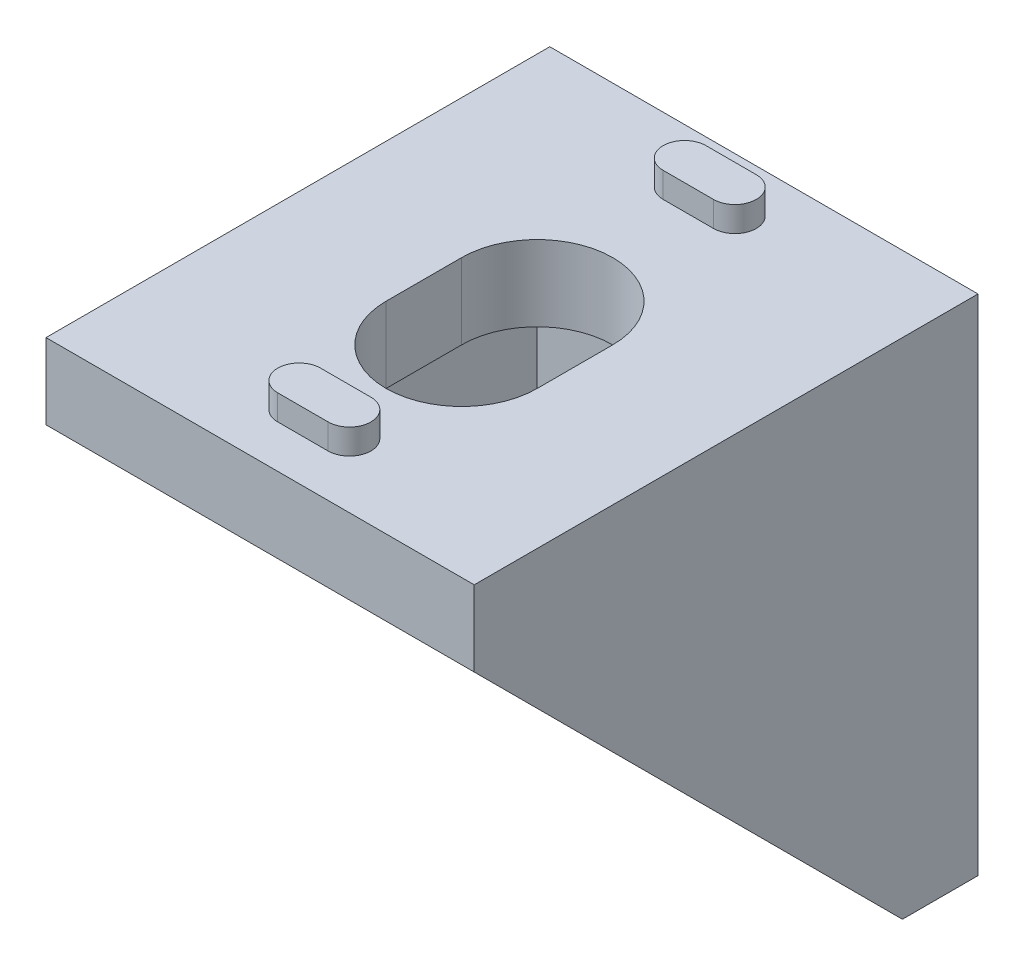
ISO-10303-21;
HEADER;
FILE_DESCRIPTION(('STEP AP214'),'2;1');
FILE_NAME('part.step','',(''),(''),'','','');
FILE_SCHEMA(('AUTOMOTIVE_DESIGN { 1 0 10303 214 1 1 1 1 }'));
ENDSEC;
DATA;
#1=APPLICATION_CONTEXT('core data for automotive mechanical design processes');
#2=APPLICATION_PROTOCOL_DEFINITION('international standard','automotive_design',2000,#1);
#3=PRODUCT_CONTEXT('',#1,'mechanical');
#4=PRODUCT('Part','Part','',(#3));
#5=PRODUCT_RELATED_PRODUCT_CATEGORY('part','',(#4));
#6=PRODUCT_DEFINITION_FORMATION('','',#4);
#7=PRODUCT_DEFINITION_CONTEXT('part definition',#1,'design');
#8=PRODUCT_DEFINITION('design','',#6,#7);
#9=PRODUCT_DEFINITION_SHAPE('','',#8);
#10=(LENGTH_UNIT() NAMED_UNIT(*) SI_UNIT(.MILLI.,.METRE.));
#11=(NAMED_UNIT(*) PLANE_ANGLE_UNIT() SI_UNIT($,.RADIAN.));
#12=(NAMED_UNIT(*) SI_UNIT($,.STERADIAN.) SOLID_ANGLE_UNIT());
#13=UNCERTAINTY_MEASURE_WITH_UNIT(LENGTH_MEASURE(1.E-05),#10,'distance_accuracy_value','');
#14=(GEOMETRIC_REPRESENTATION_CONTEXT(3) GLOBAL_UNCERTAINTY_ASSIGNED_CONTEXT((#13)) GLOBAL_UNIT_ASSIGNED_CONTEXT((#10,
#11,#12)) REPRESENTATION_CONTEXT('',''));
#15=CARTESIAN_POINT('',(0.,0.,0.));
#16=DIRECTION('',(0.,0.,1.));
#17=DIRECTION('',(1.,0.,0.));
#18=AXIS2_PLACEMENT_3D('',#15,#16,#17);
#19=CARTESIAN_POINT('',(8.5,0.,0.));
#20=DIRECTION('',(0.,-1.,0.));
#21=DIRECTION('',(0.,0.,-1.));
#22=AXIS2_PLACEMENT_3D('',#19,#20,#21);
#23=PLANE('',#22);
#24=DIRECTION('',(1.,0.,0.));
#25=VECTOR('',#24,1.);
#26=CARTESIAN_POINT('',(0.999999999999997,0.,16.6));
#27=LINE('',#26,#25);
#28=CARTESIAN_POINT('',(-1.,0.,16.6));
#29=VERTEX_POINT('',#28);
#30=CARTESIAN_POINT('',(0.999999999999997,0.,16.6));
#31=VERTEX_POINT('',#30);
#32=EDGE_CURVE('E274',#29,#31,#27,.T.);
#33=ORIENTED_EDGE('',*,*,#32,.T.);
#34=CARTESIAN_POINT('',(0.999999999999995,0.,17.45));
#35=DIRECTION('',(0.,-1.,0.));
#36=DIRECTION('',(0.,0.,-1.));
#37=AXIS2_PLACEMENT_3D('',#34,#35,#36);
#38=CIRCLE('',#37,0.85);
#39=CARTESIAN_POINT('',(0.999999999999997,0.,18.3));
#40=VERTEX_POINT('',#39);
#41=EDGE_CURVE('E248',#31,#40,#38,.T.);
#42=ORIENTED_EDGE('',*,*,#41,.T.);
#43=DIRECTION('',(-1.,0.,0.));
#44=VECTOR('',#43,1.);
#45=CARTESIAN_POINT('',(0.999999999999997,0.,18.3));
#46=LINE('',#45,#44);
#47=CARTESIAN_POINT('',(-0.999999999999999,0.,18.3));
#48=VERTEX_POINT('',#47);
#49=EDGE_CURVE('E264',#40,#48,#46,.T.);
#50=ORIENTED_EDGE('',*,*,#49,.T.);
#51=CARTESIAN_POINT('',(-1.,0.,17.45));
#52=DIRECTION('',(0.,-1.,0.));
#53=DIRECTION('',(0.,0.,1.));
#54=AXIS2_PLACEMENT_3D('',#51,#52,#53);
#55=CIRCLE('',#54,0.85);
#56=EDGE_CURVE('E48',#48,#29,#55,.T.);
#57=ORIENTED_EDGE('',*,*,#56,.T.);
#58=EDGE_LOOP('',(#33,#42,#50,#57));
#59=FACE_BOUND('',#58,.T.);
#60=DIRECTION('',(1.,0.,0.));
#61=VECTOR('',#60,1.);
#62=CARTESIAN_POINT('',(1.,0.,1.3));
#63=LINE('',#62,#61);
#64=CARTESIAN_POINT('',(-1.,0.,1.3));
#65=VERTEX_POINT('',#64);
#66=CARTESIAN_POINT('',(1.,0.,1.3));
#67=VERTEX_POINT('',#66);
#68=EDGE_CURVE('E299',#65,#67,#63,.T.);
#69=ORIENTED_EDGE('',*,*,#68,.T.);
#70=CARTESIAN_POINT('',(1.,0.,2.15));
#71=DIRECTION('',(0.,-1.,0.));
#72=DIRECTION('',(0.,0.,1.));
#73=AXIS2_PLACEMENT_3D('',#70,#71,#72);
#74=CIRCLE('',#73,0.85);
#75=CARTESIAN_POINT('',(1.,0.,3.));
#76=VERTEX_POINT('',#75);
#77=EDGE_CURVE('E253',#67,#76,#74,.T.);
#78=ORIENTED_EDGE('',*,*,#77,.T.);
#79=DIRECTION('',(-1.,0.,0.));
#80=VECTOR('',#79,1.);
#81=CARTESIAN_POINT('',(1.,0.,3.));
#82=LINE('',#81,#80);
#83=CARTESIAN_POINT('',(-0.999999999999999,0.,3.));
#84=VERTEX_POINT('',#83);
#85=EDGE_CURVE('E287',#76,#84,#82,.T.);
#86=ORIENTED_EDGE('',*,*,#85,.T.);
#87=CARTESIAN_POINT('',(-1.,0.,2.15));
#88=DIRECTION('',(0.,-1.,0.));
#89=DIRECTION('',(0.,0.,-1.));
#90=AXIS2_PLACEMENT_3D('',#87,#88,#89);
#91=CIRCLE('',#90,0.85);
#92=EDGE_CURVE('E56',#84,#65,#91,.T.);
#93=ORIENTED_EDGE('',*,*,#92,.T.);
#94=EDGE_LOOP('',(#69,#78,#86,#93));
#95=FACE_BOUND('',#94,.T.);
#96=DIRECTION('',(0.,0.,1.));
#97=VECTOR('',#96,1.);
#98=CARTESIAN_POINT('',(-8.5,0.,0.));
#99=LINE('',#98,#97);
#100=CARTESIAN_POINT('',(-8.5,0.,0.));
#101=VERTEX_POINT('',#100);
#102=CARTESIAN_POINT('',(-8.5,0.,20.));
#103=VERTEX_POINT('',#102);
#104=EDGE_CURVE('E477',#101,#103,#99,.T.);
#105=ORIENTED_EDGE('',*,*,#104,.T.);
#106=DIRECTION('',(-1.,0.,0.));
#107=VECTOR('',#106,1.);
#108=CARTESIAN_POINT('',(8.5,0.,20.));
#109=LINE('',#108,#107);
#110=CARTESIAN_POINT('',(8.5,0.,20.));
#111=VERTEX_POINT('',#110);
#112=EDGE_CURVE('E496',#111,#103,#109,.T.);
#113=ORIENTED_EDGE('',*,*,#112,.F.);
#114=DIRECTION('',(0.,0.,1.));
#115=VECTOR('',#114,1.);
#116=CARTESIAN_POINT('',(8.5,0.,0.));
#117=LINE('',#116,#115);
#118=CARTESIAN_POINT('',(8.5,0.,0.));
#119=VERTEX_POINT('',#118);
#120=EDGE_CURVE('E465',#119,#111,#117,.T.);
#121=ORIENTED_EDGE('',*,*,#120,.F.);
#122=DIRECTION('',(-1.,0.,0.));
#123=VECTOR('',#122,1.);
#124=CARTESIAN_POINT('',(8.5,0.,0.));
#125=LINE('',#124,#123);
#126=EDGE_CURVE('E499',#119,#101,#125,.T.);
#127=ORIENTED_EDGE('',*,*,#126,.T.);
#128=EDGE_LOOP('',(#105,#113,#121,#127));
#129=FACE_BOUND('',#128,.T.);
#130=CARTESIAN_POINT('',(0.,0.,9.00000000000001));
#131=DIRECTION('',(0.,-1.,0.));
#132=DIRECTION('',(0.,0.,-1.));
#133=AXIS2_PLACEMENT_3D('',#130,#131,#132);
#134=CIRCLE('',#133,3.);
#135=CARTESIAN_POINT('',(-3.,0.,9.));
#136=VERTEX_POINT('',#135);
#137=CARTESIAN_POINT('',(3.,0.,9.));
#138=VERTEX_POINT('',#137);
#139=EDGE_CURVE('E318',#136,#138,#134,.T.);
#140=ORIENTED_EDGE('',*,*,#139,.T.);
#141=DIRECTION('',(0.,0.,1.));
#142=VECTOR('',#141,1.);
#143=CARTESIAN_POINT('',(3.,0.,9.00000000000001));
#144=LINE('',#143,#142);
#145=CARTESIAN_POINT('',(3.,0.,12.));
#146=VERTEX_POINT('',#145);
#147=EDGE_CURVE('E336',#138,#146,#144,.T.);
#148=ORIENTED_EDGE('',*,*,#147,.T.);
#149=CARTESIAN_POINT('',(0.,0.,12.));
#150=DIRECTION('',(0.,-1.,0.));
#151=DIRECTION('',(0.,0.,-1.));
#152=AXIS2_PLACEMENT_3D('',#149,#150,#151);
#153=CIRCLE('',#152,3.);
#154=CARTESIAN_POINT('',(-3.,0.,12.));
#155=VERTEX_POINT('',#154);
#156=EDGE_CURVE('E312',#146,#155,#153,.T.);
#157=ORIENTED_EDGE('',*,*,#156,.T.);
#158=DIRECTION('',(0.,0.,-1.));
#159=VECTOR('',#158,1.);
#160=CARTESIAN_POINT('',(-3.,0.,9.00000000000001));
#161=LINE('',#160,#159);
#162=EDGE_CURVE('E315',#155,#136,#161,.T.);
#163=ORIENTED_EDGE('',*,*,#162,.T.);
#164=EDGE_LOOP('',(#140,#148,#157,#163));
#165=FACE_BOUND('',#164,.T.);
#166=ADVANCED_FACE('F33',(#59,#95,#129,#165),#23,.F.);
#167=CARTESIAN_POINT('',(-6.,-3.,2.99999999999999));
#168=DIRECTION('',(0.,1.,0.));
#169=DIRECTION('',(0.,0.,1.));
#170=AXIS2_PLACEMENT_3D('',#167,#168,#169);
#171=PLANE('',#170);
#172=DIRECTION('',(0.,0.,1.));
#173=VECTOR('',#172,1.);
#174=CARTESIAN_POINT('',(6.,-3.,2.99999999999999));
#175=LINE('',#174,#173);
#176=CARTESIAN_POINT('',(6.,-3.,2.99999999999999));
#177=VERTEX_POINT('',#176);
#178=CARTESIAN_POINT('',(6.,-3.,20.));
#179=VERTEX_POINT('',#178);
#180=EDGE_CURVE('E447',#177,#179,#175,.T.);
#181=ORIENTED_EDGE('',*,*,#180,.T.);
#182=DIRECTION('',(1.,0.,0.));
#183=VECTOR('',#182,1.);
#184=CARTESIAN_POINT('',(-6.,-3.,20.));
#185=LINE('',#184,#183);
#186=CARTESIAN_POINT('',(-6.,-3.,20.));
#187=VERTEX_POINT('',#186);
#188=EDGE_CURVE('E458',#187,#179,#185,.T.);
#189=ORIENTED_EDGE('',*,*,#188,.F.);
#190=DIRECTION('',(0.,0.,1.));
#191=VECTOR('',#190,1.);
#192=CARTESIAN_POINT('',(-6.,-3.,2.99999999999999));
#193=LINE('',#192,#191);
#194=CARTESIAN_POINT('',(-6.,-3.,2.99999999999999));
#195=VERTEX_POINT('',#194);
#196=EDGE_CURVE('E446',#195,#187,#193,.T.);
#197=ORIENTED_EDGE('',*,*,#196,.F.);
#198=DIRECTION('',(1.,0.,0.));
#199=VECTOR('',#198,1.);
#200=CARTESIAN_POINT('',(-6.,-3.,2.99999999999999));
#201=LINE('',#200,#199);
#202=EDGE_CURVE('E450',#195,#177,#201,.T.);
#203=ORIENTED_EDGE('',*,*,#202,.T.);
#204=EDGE_LOOP('',(#181,#189,#197,#203));
#205=FACE_BOUND('',#204,.T.);
#206=CARTESIAN_POINT('',(0.,-3.,9.));
#207=DIRECTION('',(0.,1.,0.));
#208=DIRECTION('',(-1.,0.,0.));
#209=AXIS2_PLACEMENT_3D('',#206,#207,#208);
#210=CIRCLE('',#209,3.);
#211=CARTESIAN_POINT('',(3.,-3.,9.));
#212=VERTEX_POINT('',#211);
#213=CARTESIAN_POINT('',(-3.,-3.,9.));
#214=VERTEX_POINT('',#213);
#215=EDGE_CURVE('E321',#212,#214,#210,.T.);
#216=ORIENTED_EDGE('',*,*,#215,.T.);
#217=DIRECTION('',(0.,0.,1.));
#218=VECTOR('',#217,1.);
#219=CARTESIAN_POINT('',(-3.,-3.,9.));
#220=LINE('',#219,#218);
#221=CARTESIAN_POINT('',(-3.,-3.,12.));
#222=VERTEX_POINT('',#221);
#223=EDGE_CURVE('E330',#214,#222,#220,.T.);
#224=ORIENTED_EDGE('',*,*,#223,.T.);
#225=CARTESIAN_POINT('',(0.,-3.,12.));
#226=DIRECTION('',(0.,1.,0.));
#227=DIRECTION('',(1.,0.,0.));
#228=AXIS2_PLACEMENT_3D('',#225,#226,#227);
#229=CIRCLE('',#228,3.);
#230=CARTESIAN_POINT('',(3.,-3.,12.));
#231=VERTEX_POINT('',#230);
#232=EDGE_CURVE('E327',#222,#231,#229,.T.);
#233=ORIENTED_EDGE('',*,*,#232,.T.);
#234=DIRECTION('',(0.,0.,-1.));
#235=VECTOR('',#234,1.);
#236=CARTESIAN_POINT('',(3.,-3.,9.));
#237=LINE('',#236,#235);
#238=EDGE_CURVE('E324',#231,#212,#237,.T.);
#239=ORIENTED_EDGE('',*,*,#238,.T.);
#240=EDGE_LOOP('',(#216,#224,#233,#239));
#241=FACE_BOUND('',#240,.T.);
#242=ADVANCED_FACE('F509',(#205,#241),#171,.F.);
#243=CARTESIAN_POINT('',(8.5,0.,0.));
#244=DIRECTION('',(0.,0.,1.));
#245=DIRECTION('',(0.,-1.,0.));
#246=AXIS2_PLACEMENT_3D('',#243,#244,#245);
#247=PLANE('',#246);
#248=CARTESIAN_POINT('',(1.,-2.15,0.));
#249=DIRECTION('',(0.,0.,-1.));
#250=DIRECTION('',(0.,-1.,0.));
#251=AXIS2_PLACEMENT_3D('',#248,#249,#250);
#252=CIRCLE('',#251,0.85);
#253=CARTESIAN_POINT('',(1.,-1.3,0.));
#254=VERTEX_POINT('',#253);
#255=CARTESIAN_POINT('',(1.,-3.,0.));
#256=VERTEX_POINT('',#255);
#257=EDGE_CURVE('E378',#254,#256,#252,.T.);
#258=ORIENTED_EDGE('',*,*,#257,.F.);
#259=DIRECTION('',(1.,0.,0.));
#260=VECTOR('',#259,1.);
#261=CARTESIAN_POINT('',(1.,-1.3,0.));
#262=LINE('',#261,#260);
#263=CARTESIAN_POINT('',(-0.999999999999999,-1.3,0.));
#264=VERTEX_POINT('',#263);
#265=EDGE_CURVE('E383',#264,#254,#262,.T.);
#266=ORIENTED_EDGE('',*,*,#265,.F.);
#267=CARTESIAN_POINT('',(-1.,-2.15,0.));
#268=DIRECTION('',(0.,0.,-1.));
#269=DIRECTION('',(0.,1.,0.));
#270=AXIS2_PLACEMENT_3D('',#267,#268,#269);
#271=CIRCLE('',#270,0.85);
#272=CARTESIAN_POINT('',(-1.,-3.,0.));
#273=VERTEX_POINT('',#272);
#274=EDGE_CURVE('E395',#273,#264,#271,.T.);
#275=ORIENTED_EDGE('',*,*,#274,.F.);
#276=DIRECTION('',(-1.,0.,0.));
#277=VECTOR('',#276,1.);
#278=CARTESIAN_POINT('',(1.,-3.,0.));
#279=LINE('',#278,#277);
#280=EDGE_CURVE('E392',#256,#273,#279,.T.);
#281=ORIENTED_EDGE('',*,*,#280,.F.);
#282=EDGE_LOOP('',(#258,#266,#275,#281));
#283=FACE_BOUND('',#282,.T.);
#284=DIRECTION('',(0.,-1.,0.));
#285=VECTOR('',#284,1.);
#286=CARTESIAN_POINT('',(3.,-9.00000000000001,0.));
#287=LINE('',#286,#285);
#288=CARTESIAN_POINT('',(3.,-9.00000000000001,0.));
#289=VERTEX_POINT('',#288);
#290=CARTESIAN_POINT('',(3.,-12.,0.));
#291=VERTEX_POINT('',#290);
#292=EDGE_CURVE('E413',#289,#291,#287,.T.);
#293=ORIENTED_EDGE('',*,*,#292,.F.);
#294=CARTESIAN_POINT('',(0.,-9.00000000000001,0.));
#295=DIRECTION('',(0.,0.,1.));
#296=DIRECTION('',(0.,-1.,0.));
#297=AXIS2_PLACEMENT_3D('',#294,#295,#296);
#298=CIRCLE('',#297,3.);
#299=CARTESIAN_POINT('',(-3.,-9.00000000000001,0.));
#300=VERTEX_POINT('',#299);
#301=EDGE_CURVE('E416',#300,#289,#298,.F.);
#302=ORIENTED_EDGE('',*,*,#301,.F.);
#303=DIRECTION('',(0.,1.,0.));
#304=VECTOR('',#303,1.);
#305=CARTESIAN_POINT('',(-3.,-9.00000000000001,0.));
#306=LINE('',#305,#304);
#307=CARTESIAN_POINT('',(-3.,-12.,0.));
#308=VERTEX_POINT('',#307);
#309=EDGE_CURVE('E433',#308,#300,#306,.T.);
#310=ORIENTED_EDGE('',*,*,#309,.F.);
#311=CARTESIAN_POINT('',(0.,-12.,0.));
#312=DIRECTION('',(0.,0.,1.));
#313=DIRECTION('',(0.,-1.,0.));
#314=AXIS2_PLACEMENT_3D('',#311,#312,#313);
#315=CIRCLE('',#314,3.);
#316=EDGE_CURVE('E411',#291,#308,#315,.F.);
#317=ORIENTED_EDGE('',*,*,#316,.F.);
#318=EDGE_LOOP('',(#293,#302,#310,#317));
#319=FACE_BOUND('',#318,.T.);
#320=DIRECTION('',(0.,1.,0.));
#321=VECTOR('',#320,1.);
#322=CARTESIAN_POINT('',(-8.5,0.,0.));
#323=LINE('',#322,#321);
#324=CARTESIAN_POINT('',(-8.5,-20.,0.));
#325=VERTEX_POINT('',#324);
#326=EDGE_CURVE('E457',#325,#101,#323,.T.);
#327=ORIENTED_EDGE('',*,*,#326,.T.);
#328=ORIENTED_EDGE('',*,*,#126,.F.);
#329=DIRECTION('',(0.,1.,0.));
#330=VECTOR('',#329,1.);
#331=CARTESIAN_POINT('',(8.5,0.,0.));
#332=LINE('',#331,#330);
#333=CARTESIAN_POINT('',(8.5,-20.,0.));
#334=VERTEX_POINT('',#333);
#335=EDGE_CURVE('E462',#334,#119,#332,.T.);
#336=ORIENTED_EDGE('',*,*,#335,.F.);
#337=DIRECTION('',(-1.,0.,0.));
#338=VECTOR('',#337,1.);
#339=CARTESIAN_POINT('',(8.5,-20.,0.));
#340=LINE('',#339,#338);
#341=EDGE_CURVE('E474',#334,#325,#340,.T.);
#342=ORIENTED_EDGE('',*,*,#341,.T.);
#343=EDGE_LOOP('',(#327,#328,#336,#342));
#344=FACE_BOUND('',#343,.T.);
#345=CARTESIAN_POINT('',(0.999999999999995,-17.45,0.));
#346=DIRECTION('',(0.,0.,-1.));
#347=DIRECTION('',(0.,1.,0.));
#348=AXIS2_PLACEMENT_3D('',#345,#346,#347);
#349=CIRCLE('',#348,0.85);
#350=CARTESIAN_POINT('',(0.999999999999997,-16.6,0.));
#351=VERTEX_POINT('',#350);
#352=CARTESIAN_POINT('',(0.999999999999997,-18.3,0.));
#353=VERTEX_POINT('',#352);
#354=EDGE_CURVE('E345',#351,#353,#349,.T.);
#355=ORIENTED_EDGE('',*,*,#354,.F.);
#356=DIRECTION('',(1.,0.,0.));
#357=VECTOR('',#356,1.);
#358=CARTESIAN_POINT('',(0.999999999999997,-16.6,0.));
#359=LINE('',#358,#357);
#360=CARTESIAN_POINT('',(-1.,-16.6,0.));
#361=VERTEX_POINT('',#360);
#362=EDGE_CURVE('E350',#361,#351,#359,.T.);
#363=ORIENTED_EDGE('',*,*,#362,.F.);
#364=CARTESIAN_POINT('',(-1.,-17.45,0.));
#365=DIRECTION('',(0.,0.,-1.));
#366=DIRECTION('',(0.,-1.,0.));
#367=AXIS2_PLACEMENT_3D('',#364,#365,#366);
#368=CIRCLE('',#367,0.85);
#369=CARTESIAN_POINT('',(-1.,-18.3,0.));
#370=VERTEX_POINT('',#369);
#371=EDGE_CURVE('E362',#370,#361,#368,.T.);
#372=ORIENTED_EDGE('',*,*,#371,.F.);
#373=DIRECTION('',(-1.,0.,0.));
#374=VECTOR('',#373,1.);
#375=CARTESIAN_POINT('',(0.999999999999997,-18.3,0.));
#376=LINE('',#375,#374);
#377=EDGE_CURVE('E359',#353,#370,#376,.T.);
#378=ORIENTED_EDGE('',*,*,#377,.F.);
#379=EDGE_LOOP('',(#355,#363,#372,#378));
#380=FACE_BOUND('',#379,.T.);
#381=ADVANCED_FACE('F35',(#283,#319,#344,#380),#247,.F.);
#382=CARTESIAN_POINT('',(8.5,-20.,2.99999999999999));
#383=DIRECTION('',(0.,0.707106781186548,-0.707106781186547));
#384=DIRECTION('',(0.,0.707106781186547,0.707106781186548));
#385=AXIS2_PLACEMENT_3D('',#382,#383,#384);
#386=PLANE('',#385);
#387=DIRECTION('',(0.,0.707106781186547,0.707106781186548));
#388=VECTOR('',#387,1.);
#389=CARTESIAN_POINT('',(6.,-20.,2.99999999999999));
#390=LINE('',#389,#388);
#391=CARTESIAN_POINT('',(6.,-20.,2.99999999999999));
#392=VERTEX_POINT('',#391);
#393=EDGE_CURVE('E41',#392,#179,#390,.T.);
#394=ORIENTED_EDGE('',*,*,#393,.F.);
#395=DIRECTION('',(-1.,0.,0.));
#396=VECTOR('',#395,1.);
#397=CARTESIAN_POINT('',(8.5,-20.,2.99999999999999));
#398=LINE('',#397,#396);
#399=CARTESIAN_POINT('',(8.5,-20.,2.99999999999999));
#400=VERTEX_POINT('',#399);
#401=EDGE_CURVE('E489',#400,#392,#398,.T.);
#402=ORIENTED_EDGE('',*,*,#401,.F.);
#403=DIRECTION('',(0.,-0.707106781186548,-0.707106781186548));
#404=VECTOR('',#403,1.);
#405=CARTESIAN_POINT('',(8.5,-3.,20.));
#406=LINE('',#405,#404);
#407=CARTESIAN_POINT('',(8.5,-3.,20.));
#408=VERTEX_POINT('',#407);
#409=EDGE_CURVE('E470',#408,#400,#406,.T.);
#410=ORIENTED_EDGE('',*,*,#409,.F.);
#411=DIRECTION('',(-1.,0.,0.));
#412=VECTOR('',#411,1.);
#413=CARTESIAN_POINT('',(8.5,-3.,20.));
#414=LINE('',#413,#412);
#415=EDGE_CURVE('E493',#408,#179,#414,.T.);
#416=ORIENTED_EDGE('',*,*,#415,.T.);
#417=EDGE_LOOP('',(#394,#402,#410,#416));
#418=FACE_BOUND('',#417,.T.);
#419=ADVANCED_FACE('F518',(#418),#386,.F.);
#420=CARTESIAN_POINT('',(8.5,0.,20.));
#421=DIRECTION('',(0.,0.,-1.));
#422=DIRECTION('',(-1.,0.,0.));
#423=AXIS2_PLACEMENT_3D('',#420,#421,#422);
#424=PLANE('',#423);
#425=DIRECTION('',(0.,-1.,0.));
#426=VECTOR('',#425,1.);
#427=CARTESIAN_POINT('',(-8.5,0.,20.));
#428=LINE('',#427,#426);
#429=CARTESIAN_POINT('',(-8.5,-3.,20.));
#430=VERTEX_POINT('',#429);
#431=EDGE_CURVE('E479',#103,#430,#428,.T.);
#432=ORIENTED_EDGE('',*,*,#431,.T.);
#433=EDGE_CURVE('E492',#187,#430,#414,.T.);
#434=ORIENTED_EDGE('',*,*,#433,.F.);
#435=ORIENTED_EDGE('',*,*,#188,.T.);
#436=ORIENTED_EDGE('',*,*,#415,.F.);
#437=DIRECTION('',(0.,-1.,0.));
#438=VECTOR('',#437,1.);
#439=CARTESIAN_POINT('',(8.5,0.,20.));
#440=LINE('',#439,#438);
#441=EDGE_CURVE('E468',#111,#408,#440,.T.);
#442=ORIENTED_EDGE('',*,*,#441,.F.);
#443=ORIENTED_EDGE('',*,*,#112,.T.);
#444=EDGE_LOOP('',(#432,#434,#435,#436,#442,#443));
#445=FACE_BOUND('',#444,.T.);
#446=ADVANCED_FACE('F515',(#445),#424,.F.);
#447=CARTESIAN_POINT('',(-6.,-20.,2.99999999999999));
#448=VERTEX_POINT('',#447);
#449=CARTESIAN_POINT('',(-8.5,-20.,2.99999999999999));
#450=VERTEX_POINT('',#449);
#451=EDGE_CURVE('E488',#448,#450,#398,.T.);
#452=ORIENTED_EDGE('',*,*,#451,.F.);
#453=DIRECTION('',(0.,0.707106781186547,0.707106781186548));
#454=VECTOR('',#453,1.);
#455=CARTESIAN_POINT('',(-6.,-20.,2.99999999999999));
#456=LINE('',#455,#454);
#457=EDGE_CURVE('E11',#448,#187,#456,.T.);
#458=ORIENTED_EDGE('',*,*,#457,.T.);
#459=ORIENTED_EDGE('',*,*,#433,.T.);
#460=DIRECTION('',(0.,-0.707106781186547,-0.707106781186548));
#461=VECTOR('',#460,1.);
#462=CARTESIAN_POINT('',(-8.5,-20.,2.99999999999999));
#463=LINE('',#462,#461);
#464=EDGE_CURVE('E482',#430,#450,#463,.T.);
#465=ORIENTED_EDGE('',*,*,#464,.T.);
#466=EDGE_LOOP('',(#452,#458,#459,#465));
#467=FACE_BOUND('',#466,.T.);
#468=ADVANCED_FACE('F533',(#467),#386,.F.);
#469=CARTESIAN_POINT('',(8.5,-20.,0.));
#470=DIRECTION('',(0.,1.,0.));
#471=DIRECTION('',(0.,0.,1.));
#472=AXIS2_PLACEMENT_3D('',#469,#470,#471);
#473=PLANE('',#472);
#474=DIRECTION('',(0.,0.,-1.));
#475=VECTOR('',#474,1.);
#476=CARTESIAN_POINT('',(-8.5,-20.,0.));
#477=LINE('',#476,#475);
#478=EDGE_CURVE('E466',#450,#325,#477,.T.);
#479=ORIENTED_EDGE('',*,*,#478,.T.);
#480=ORIENTED_EDGE('',*,*,#341,.F.);
#481=DIRECTION('',(0.,0.,-1.));
#482=VECTOR('',#481,1.);
#483=CARTESIAN_POINT('',(8.5,-20.,0.));
#484=LINE('',#483,#482);
#485=EDGE_CURVE('E472',#400,#334,#484,.T.);
#486=ORIENTED_EDGE('',*,*,#485,.F.);
#487=ORIENTED_EDGE('',*,*,#401,.T.);
#488=DIRECTION('',(1.,0.,0.));
#489=VECTOR('',#488,1.);
#490=CARTESIAN_POINT('',(-6.,-20.,2.99999999999999));
#491=LINE('',#490,#489);
#492=EDGE_CURVE('E455',#448,#392,#491,.T.);
#493=ORIENTED_EDGE('',*,*,#492,.F.);
#494=ORIENTED_EDGE('',*,*,#451,.T.);
#495=EDGE_LOOP('',(#479,#480,#486,#487,#493,#494));
#496=FACE_BOUND('',#495,.T.);
#497=ADVANCED_FACE('F541',(#496),#473,.F.);
#498=CARTESIAN_POINT('',(8.5,0.,0.));
#499=DIRECTION('',(-1.,0.,0.));
#500=DIRECTION('',(0.,0.,1.));
#501=AXIS2_PLACEMENT_3D('',#498,#499,#500);
#502=PLANE('',#501);
#503=ORIENTED_EDGE('',*,*,#335,.T.);
#504=ORIENTED_EDGE('',*,*,#120,.T.);
#505=ORIENTED_EDGE('',*,*,#441,.T.);
#506=ORIENTED_EDGE('',*,*,#409,.T.);
#507=ORIENTED_EDGE('',*,*,#485,.T.);
#508=EDGE_LOOP('',(#503,#504,#505,#506,#507));
#509=FACE_BOUND('',#508,.T.);
#510=ADVANCED_FACE('F521',(#509),#502,.F.);
#511=CARTESIAN_POINT('',(-8.5,0.,0.));
#512=DIRECTION('',(-1.,0.,0.));
#513=DIRECTION('',(0.,0.,1.));
#514=AXIS2_PLACEMENT_3D('',#511,#512,#513);
#515=PLANE('',#514);
#516=ORIENTED_EDGE('',*,*,#326,.F.);
#517=ORIENTED_EDGE('',*,*,#478,.F.);
#518=ORIENTED_EDGE('',*,*,#464,.F.);
#519=ORIENTED_EDGE('',*,*,#431,.F.);
#520=ORIENTED_EDGE('',*,*,#104,.F.);
#521=EDGE_LOOP('',(#516,#517,#518,#519,#520));
#522=FACE_BOUND('',#521,.T.);
#523=ADVANCED_FACE('F529',(#522),#515,.T.);
#524=CARTESIAN_POINT('',(-6.,0.,0.));
#525=DIRECTION('',(-1.,0.,0.));
#526=DIRECTION('',(0.,0.,1.));
#527=AXIS2_PLACEMENT_3D('',#524,#525,#526);
#528=PLANE('',#527);
#529=DIRECTION('',(0.,1.,0.));
#530=VECTOR('',#529,1.);
#531=CARTESIAN_POINT('',(-6.,-3.,2.99999999999999));
#532=LINE('',#531,#530);
#533=EDGE_CURVE('E443',#448,#195,#532,.T.);
#534=ORIENTED_EDGE('',*,*,#533,.T.);
#535=ORIENTED_EDGE('',*,*,#196,.T.);
#536=ORIENTED_EDGE('',*,*,#457,.F.);
#537=EDGE_LOOP('',(#534,#535,#536));
#538=FACE_BOUND('',#537,.T.);
#539=ADVANCED_FACE('F537',(#538),#528,.F.);
#540=CARTESIAN_POINT('',(6.,0.,0.));
#541=DIRECTION('',(-1.,0.,0.));
#542=DIRECTION('',(0.,0.,1.));
#543=AXIS2_PLACEMENT_3D('',#540,#541,#542);
#544=PLANE('',#543);
#545=ORIENTED_EDGE('',*,*,#393,.T.);
#546=ORIENTED_EDGE('',*,*,#180,.F.);
#547=DIRECTION('',(0.,1.,0.));
#548=VECTOR('',#547,1.);
#549=CARTESIAN_POINT('',(6.,-3.,2.99999999999999));
#550=LINE('',#549,#548);
#551=EDGE_CURVE('E442',#392,#177,#550,.T.);
#552=ORIENTED_EDGE('',*,*,#551,.F.);
#553=EDGE_LOOP('',(#545,#546,#552));
#554=FACE_BOUND('',#553,.T.);
#555=ADVANCED_FACE('F505',(#554),#544,.T.);
#556=CARTESIAN_POINT('',(-6.,-3.,2.99999999999999));
#557=DIRECTION('',(0.,0.,-1.));
#558=DIRECTION('',(0.,1.,0.));
#559=AXIS2_PLACEMENT_3D('',#556,#557,#558);
#560=PLANE('',#559);
#561=DIRECTION('',(0.,-1.,0.));
#562=VECTOR('',#561,1.);
#563=CARTESIAN_POINT('',(-3.,-9.00000000000001,2.99999999999999));
#564=LINE('',#563,#562);
#565=CARTESIAN_POINT('',(-3.,-9.00000000000001,2.99999999999999));
#566=VERTEX_POINT('',#565);
#567=CARTESIAN_POINT('',(-3.,-12.,2.99999999999999));
#568=VERTEX_POINT('',#567);
#569=EDGE_CURVE('E421',#566,#568,#564,.T.);
#570=ORIENTED_EDGE('',*,*,#569,.F.);
#571=CARTESIAN_POINT('',(0.,-9.00000000000001,2.99999999999999));
#572=DIRECTION('',(0.,0.,1.));
#573=DIRECTION('',(-1.,0.,0.));
#574=AXIS2_PLACEMENT_3D('',#571,#572,#573);
#575=CIRCLE('',#574,3.);
#576=CARTESIAN_POINT('',(3.,-9.00000000000001,2.99999999999999));
#577=VERTEX_POINT('',#576);
#578=EDGE_CURVE('E419',#577,#566,#575,.T.);
#579=ORIENTED_EDGE('',*,*,#578,.F.);
#580=DIRECTION('',(0.,1.,0.));
#581=VECTOR('',#580,1.);
#582=CARTESIAN_POINT('',(3.,-9.00000000000001,2.99999999999999));
#583=LINE('',#582,#581);
#584=CARTESIAN_POINT('',(3.,-12.,2.99999999999999));
#585=VERTEX_POINT('',#584);
#586=EDGE_CURVE('E427',#585,#577,#583,.T.);
#587=ORIENTED_EDGE('',*,*,#586,.F.);
#588=CARTESIAN_POINT('',(0.,-12.,2.99999999999999));
#589=DIRECTION('',(0.,0.,1.));
#590=DIRECTION('',(1.,0.,0.));
#591=AXIS2_PLACEMENT_3D('',#588,#589,#590);
#592=CIRCLE('',#591,3.);
#593=EDGE_CURVE('E424',#568,#585,#592,.T.);
#594=ORIENTED_EDGE('',*,*,#593,.F.);
#595=EDGE_LOOP('',(#570,#579,#587,#594));
#596=FACE_BOUND('',#595,.T.);
#597=ORIENTED_EDGE('',*,*,#551,.T.);
#598=ORIENTED_EDGE('',*,*,#202,.F.);
#599=ORIENTED_EDGE('',*,*,#533,.F.);
#600=ORIENTED_EDGE('',*,*,#492,.T.);
#601=EDGE_LOOP('',(#597,#598,#599,#600));
#602=FACE_BOUND('',#601,.T.);
#603=ADVANCED_FACE('F539',(#596,#602),#560,.F.);
#604=CARTESIAN_POINT('',(0.,-9.00000000000001,-0.00100000000001401));
#605=DIRECTION('',(0.,0.,1.));
#606=DIRECTION('',(1.,0.,0.));
#607=AXIS2_PLACEMENT_3D('',#604,#605,#606);
#608=CYLINDRICAL_SURFACE('',#607,3.);
#609=ORIENTED_EDGE('',*,*,#301,.T.);
#610=DIRECTION('',(0.,0.,1.));
#611=VECTOR('',#610,1.);
#612=CARTESIAN_POINT('',(3.,-9.00000000000001,-0.00100000000001401));
#613=LINE('',#612,#611);
#614=EDGE_CURVE('E431',#289,#577,#613,.T.);
#615=ORIENTED_EDGE('',*,*,#614,.T.);
#616=ORIENTED_EDGE('',*,*,#578,.T.);
#617=DIRECTION('',(0.,0.,1.));
#618=VECTOR('',#617,1.);
#619=CARTESIAN_POINT('',(-3.,-9.00000000000001,-0.00100000000001401));
#620=LINE('',#619,#618);
#621=EDGE_CURVE('E430',#300,#566,#620,.T.);
#622=ORIENTED_EDGE('',*,*,#621,.F.);
#623=EDGE_LOOP('',(#609,#615,#616,#622));
#624=FACE_BOUND('',#623,.T.);
#625=ADVANCED_FACE('F622',(#624),#608,.F.);
#626=CARTESIAN_POINT('',(3.,-9.00000000000001,-0.00100000000001401));
#627=DIRECTION('',(1.,0.,0.));
#628=DIRECTION('',(0.,1.,0.));
#629=AXIS2_PLACEMENT_3D('',#626,#627,#628);
#630=PLANE('',#629);
#631=ORIENTED_EDGE('',*,*,#292,.T.);
#632=DIRECTION('',(0.,0.,1.));
#633=VECTOR('',#632,1.);
#634=CARTESIAN_POINT('',(3.,-12.,-0.00100000000001401));
#635=LINE('',#634,#633);
#636=EDGE_CURVE('E434',#291,#585,#635,.T.);
#637=ORIENTED_EDGE('',*,*,#636,.T.);
#638=ORIENTED_EDGE('',*,*,#586,.T.);
#639=ORIENTED_EDGE('',*,*,#614,.F.);
#640=EDGE_LOOP('',(#631,#637,#638,#639));
#641=FACE_BOUND('',#640,.T.);
#642=ADVANCED_FACE('F618',(#641),#630,.F.);
#643=CARTESIAN_POINT('',(0.,-12.,-0.00100000000001401));
#644=DIRECTION('',(0.,0.,1.));
#645=DIRECTION('',(1.,0.,0.));
#646=AXIS2_PLACEMENT_3D('',#643,#644,#645);
#647=CYLINDRICAL_SURFACE('',#646,3.);
#648=ORIENTED_EDGE('',*,*,#316,.T.);
#649=DIRECTION('',(0.,0.,1.));
#650=VECTOR('',#649,1.);
#651=CARTESIAN_POINT('',(-3.,-12.,-0.00100000000001401));
#652=LINE('',#651,#650);
#653=EDGE_CURVE('E436',#308,#568,#652,.T.);
#654=ORIENTED_EDGE('',*,*,#653,.T.);
#655=ORIENTED_EDGE('',*,*,#593,.T.);
#656=ORIENTED_EDGE('',*,*,#636,.F.);
#657=EDGE_LOOP('',(#648,#654,#655,#656));
#658=FACE_BOUND('',#657,.T.);
#659=ADVANCED_FACE('F621',(#658),#647,.F.);
#660=CARTESIAN_POINT('',(-3.,-9.00000000000001,-0.00100000000001401));
#661=DIRECTION('',(-1.,0.,0.));
#662=DIRECTION('',(0.,-1.,0.));
#663=AXIS2_PLACEMENT_3D('',#660,#661,#662);
#664=PLANE('',#663);
#665=ORIENTED_EDGE('',*,*,#309,.T.);
#666=ORIENTED_EDGE('',*,*,#621,.T.);
#667=ORIENTED_EDGE('',*,*,#569,.T.);
#668=ORIENTED_EDGE('',*,*,#653,.F.);
#669=EDGE_LOOP('',(#665,#666,#667,#668));
#670=FACE_BOUND('',#669,.T.);
#671=ADVANCED_FACE('F616',(#670),#664,.F.);
#672=CARTESIAN_POINT('',(1.,-2.15,-1.));
#673=DIRECTION('',(0.,0.,1.));
#674=DIRECTION('',(0.,-1.,0.));
#675=AXIS2_PLACEMENT_3D('',#672,#673,#674);
#676=CYLINDRICAL_SURFACE('',#675,0.85);
#677=ORIENTED_EDGE('',*,*,#257,.T.);
#678=DIRECTION('',(0.,0.,1.));
#679=VECTOR('',#678,1.);
#680=CARTESIAN_POINT('',(1.,-3.,-1.));
#681=LINE('',#680,#679);
#682=CARTESIAN_POINT('',(1.,-3.,-1.));
#683=VERTEX_POINT('',#682);
#684=EDGE_CURVE('E408',#683,#256,#681,.T.);
#685=ORIENTED_EDGE('',*,*,#684,.F.);
#686=CARTESIAN_POINT('',(1.,-2.15,-1.));
#687=DIRECTION('',(0.,0.,-1.));
#688=DIRECTION('',(0.,-1.,0.));
#689=AXIS2_PLACEMENT_3D('',#686,#687,#688);
#690=CIRCLE('',#689,0.85);
#691=CARTESIAN_POINT('',(1.,-1.3,-1.));
#692=VERTEX_POINT('',#691);
#693=EDGE_CURVE('E379',#692,#683,#690,.T.);
#694=ORIENTED_EDGE('',*,*,#693,.F.);
#695=DIRECTION('',(0.,0.,1.));
#696=VECTOR('',#695,1.);
#697=CARTESIAN_POINT('',(1.,-1.3,-1.));
#698=LINE('',#697,#696);
#699=EDGE_CURVE('E389',#692,#254,#698,.T.);
#700=ORIENTED_EDGE('',*,*,#699,.T.);
#701=EDGE_LOOP('',(#677,#685,#694,#700));
#702=FACE_BOUND('',#701,.T.);
#703=ADVANCED_FACE('F612',(#702),#676,.T.);
#704=CARTESIAN_POINT('',(1.,-3.,-1.));
#705=DIRECTION('',(0.,1.,0.));
#706=DIRECTION('',(0.,0.,1.));
#707=AXIS2_PLACEMENT_3D('',#704,#705,#706);
#708=PLANE('',#707);
#709=ORIENTED_EDGE('',*,*,#280,.T.);
#710=DIRECTION('',(0.,0.,1.));
#711=VECTOR('',#710,1.);
#712=CARTESIAN_POINT('',(-0.999999999999999,-3.,-1.));
#713=LINE('',#712,#711);
#714=CARTESIAN_POINT('',(-0.999999999999999,-3.,-1.));
#715=VERTEX_POINT('',#714);
#716=EDGE_CURVE('E405',#715,#273,#713,.T.);
#717=ORIENTED_EDGE('',*,*,#716,.F.);
#718=DIRECTION('',(-1.,0.,0.));
#719=VECTOR('',#718,1.);
#720=CARTESIAN_POINT('',(1.,-3.,-1.));
#721=LINE('',#720,#719);
#722=EDGE_CURVE('E382',#683,#715,#721,.T.);
#723=ORIENTED_EDGE('',*,*,#722,.F.);
#724=ORIENTED_EDGE('',*,*,#684,.T.);
#725=EDGE_LOOP('',(#709,#717,#723,#724));
#726=FACE_BOUND('',#725,.T.);
#727=ADVANCED_FACE('F608',(#726),#708,.F.);
#728=CARTESIAN_POINT('',(-1.,-2.15,-1.));
#729=DIRECTION('',(0.,0.,1.));
#730=DIRECTION('',(0.,-1.,0.));
#731=AXIS2_PLACEMENT_3D('',#728,#729,#730);
#732=CYLINDRICAL_SURFACE('',#731,0.85);
#733=ORIENTED_EDGE('',*,*,#274,.T.);
#734=DIRECTION('',(0.,0.,1.));
#735=VECTOR('',#734,1.);
#736=CARTESIAN_POINT('',(-1.,-1.3,-1.));
#737=LINE('',#736,#735);
#738=CARTESIAN_POINT('',(-1.,-1.3,-1.));
#739=VERTEX_POINT('',#738);
#740=EDGE_CURVE('E402',#739,#264,#737,.T.);
#741=ORIENTED_EDGE('',*,*,#740,.F.);
#742=CARTESIAN_POINT('',(-1.,-2.15,-1.));
#743=DIRECTION('',(0.,0.,-1.));
#744=DIRECTION('',(0.,1.,0.));
#745=AXIS2_PLACEMENT_3D('',#742,#743,#744);
#746=CIRCLE('',#745,0.85);
#747=EDGE_CURVE('E385',#715,#739,#746,.T.);
#748=ORIENTED_EDGE('',*,*,#747,.F.);
#749=ORIENTED_EDGE('',*,*,#716,.T.);
#750=EDGE_LOOP('',(#733,#741,#748,#749));
#751=FACE_BOUND('',#750,.T.);
#752=ADVANCED_FACE('F604',(#751),#732,.T.);
#753=CARTESIAN_POINT('',(1.,-1.3,-1.));
#754=DIRECTION('',(0.,-1.,0.));
#755=DIRECTION('',(0.,0.,-1.));
#756=AXIS2_PLACEMENT_3D('',#753,#754,#755);
#757=PLANE('',#756);
#758=ORIENTED_EDGE('',*,*,#265,.T.);
#759=ORIENTED_EDGE('',*,*,#699,.F.);
#760=DIRECTION('',(1.,0.,0.));
#761=VECTOR('',#760,1.);
#762=CARTESIAN_POINT('',(1.,-1.3,-1.));
#763=LINE('',#762,#761);
#764=EDGE_CURVE('E387',#739,#692,#763,.T.);
#765=ORIENTED_EDGE('',*,*,#764,.F.);
#766=ORIENTED_EDGE('',*,*,#740,.T.);
#767=EDGE_LOOP('',(#758,#759,#765,#766));
#768=FACE_BOUND('',#767,.T.);
#769=ADVANCED_FACE('F600',(#768),#757,.F.);
#770=CARTESIAN_POINT('',(1.,-2.15,-1.));
#771=DIRECTION('',(0.,0.,1.));
#772=DIRECTION('',(0.,-1.,0.));
#773=AXIS2_PLACEMENT_3D('',#770,#771,#772);
#774=PLANE('',#773);
#775=ORIENTED_EDGE('',*,*,#693,.T.);
#776=ORIENTED_EDGE('',*,*,#722,.T.);
#777=ORIENTED_EDGE('',*,*,#747,.T.);
#778=ORIENTED_EDGE('',*,*,#764,.T.);
#779=EDGE_LOOP('',(#775,#776,#777,#778));
#780=FACE_BOUND('',#779,.T.);
#781=ADVANCED_FACE('F596',(#780),#774,.F.);
#782=CARTESIAN_POINT('',(0.999999999999995,-17.45,-1.00000000000001));
#783=DIRECTION('',(0.,0.,1.));
#784=DIRECTION('',(0.,-1.,0.));
#785=AXIS2_PLACEMENT_3D('',#782,#783,#784);
#786=CYLINDRICAL_SURFACE('',#785,0.85);
#787=ORIENTED_EDGE('',*,*,#354,.T.);
#788=DIRECTION('',(0.,0.,1.));
#789=VECTOR('',#788,1.);
#790=CARTESIAN_POINT('',(0.999999999999997,-18.3,-1.00000000000001));
#791=LINE('',#790,#789);
#792=CARTESIAN_POINT('',(0.999999999999997,-18.3,-1.00000000000001));
#793=VERTEX_POINT('',#792);
#794=EDGE_CURVE('E375',#793,#353,#791,.T.);
#795=ORIENTED_EDGE('',*,*,#794,.F.);
#796=CARTESIAN_POINT('',(0.999999999999995,-17.45,-1.00000000000001));
#797=DIRECTION('',(0.,0.,-1.));
#798=DIRECTION('',(0.,1.,0.));
#799=AXIS2_PLACEMENT_3D('',#796,#797,#798);
#800=CIRCLE('',#799,0.85);
#801=CARTESIAN_POINT('',(0.999999999999997,-16.6,-1.00000000000001));
#802=VERTEX_POINT('',#801);
#803=EDGE_CURVE('E346',#802,#793,#800,.T.);
#804=ORIENTED_EDGE('',*,*,#803,.F.);
#805=DIRECTION('',(0.,0.,1.));
#806=VECTOR('',#805,1.);
#807=CARTESIAN_POINT('',(0.999999999999997,-16.6,-1.00000000000001));
#808=LINE('',#807,#806);
#809=EDGE_CURVE('E356',#802,#351,#808,.T.);
#810=ORIENTED_EDGE('',*,*,#809,.T.);
#811=EDGE_LOOP('',(#787,#795,#804,#810));
#812=FACE_BOUND('',#811,.T.);
#813=ADVANCED_FACE('F592',(#812),#786,.T.);
#814=CARTESIAN_POINT('',(0.999999999999997,-18.3,-1.00000000000001));
#815=DIRECTION('',(0.,1.,0.));
#816=DIRECTION('',(0.,0.,1.));
#817=AXIS2_PLACEMENT_3D('',#814,#815,#816);
#818=PLANE('',#817);
#819=ORIENTED_EDGE('',*,*,#377,.T.);
#820=DIRECTION('',(0.,0.,1.));
#821=VECTOR('',#820,1.);
#822=CARTESIAN_POINT('',(-1.,-18.3,-1.00000000000001));
#823=LINE('',#822,#821);
#824=CARTESIAN_POINT('',(-1.,-18.3,-1.00000000000001));
#825=VERTEX_POINT('',#824);
#826=EDGE_CURVE('E372',#825,#370,#823,.T.);
#827=ORIENTED_EDGE('',*,*,#826,.F.);
#828=DIRECTION('',(-1.,0.,0.));
#829=VECTOR('',#828,1.);
#830=CARTESIAN_POINT('',(0.999999999999997,-18.3,-1.00000000000001));
#831=LINE('',#830,#829);
#832=EDGE_CURVE('E349',#793,#825,#831,.T.);
#833=ORIENTED_EDGE('',*,*,#832,.F.);
#834=ORIENTED_EDGE('',*,*,#794,.T.);
#835=EDGE_LOOP('',(#819,#827,#833,#834));
#836=FACE_BOUND('',#835,.T.);
#837=ADVANCED_FACE('F588',(#836),#818,.F.);
#838=CARTESIAN_POINT('',(-1.,-17.45,-1.00000000000001));
#839=DIRECTION('',(0.,0.,1.));
#840=DIRECTION('',(0.,-1.,0.));
#841=AXIS2_PLACEMENT_3D('',#838,#839,#840);
#842=CYLINDRICAL_SURFACE('',#841,0.85);
#843=ORIENTED_EDGE('',*,*,#371,.T.);
#844=DIRECTION('',(0.,0.,1.));
#845=VECTOR('',#844,1.);
#846=CARTESIAN_POINT('',(-1.,-16.6,-1.00000000000001));
#847=LINE('',#846,#845);
#848=CARTESIAN_POINT('',(-1.,-16.6,-1.00000000000001));
#849=VERTEX_POINT('',#848);
#850=EDGE_CURVE('E369',#849,#361,#847,.T.);
#851=ORIENTED_EDGE('',*,*,#850,.F.);
#852=CARTESIAN_POINT('',(-1.,-17.45,-1.00000000000001));
#853=DIRECTION('',(0.,0.,-1.));
#854=DIRECTION('',(0.,-1.,0.));
#855=AXIS2_PLACEMENT_3D('',#852,#853,#854);
#856=CIRCLE('',#855,0.85);
#857=EDGE_CURVE('E352',#825,#849,#856,.T.);
#858=ORIENTED_EDGE('',*,*,#857,.F.);
#859=ORIENTED_EDGE('',*,*,#826,.T.);
#860=EDGE_LOOP('',(#843,#851,#858,#859));
#861=FACE_BOUND('',#860,.T.);
#862=ADVANCED_FACE('F584',(#861),#842,.T.);
#863=CARTESIAN_POINT('',(0.999999999999997,-16.6,-1.00000000000001));
#864=DIRECTION('',(0.,-1.,0.));
#865=DIRECTION('',(0.,0.,-1.));
#866=AXIS2_PLACEMENT_3D('',#863,#864,#865);
#867=PLANE('',#866);
#868=ORIENTED_EDGE('',*,*,#362,.T.);
#869=ORIENTED_EDGE('',*,*,#809,.F.);
#870=DIRECTION('',(1.,0.,0.));
#871=VECTOR('',#870,1.);
#872=CARTESIAN_POINT('',(0.999999999999997,-16.6,-1.00000000000001));
#873=LINE('',#872,#871);
#874=EDGE_CURVE('E354',#849,#802,#873,.T.);
#875=ORIENTED_EDGE('',*,*,#874,.F.);
#876=ORIENTED_EDGE('',*,*,#850,.T.);
#877=EDGE_LOOP('',(#868,#869,#875,#876));
#878=FACE_BOUND('',#877,.T.);
#879=ADVANCED_FACE('F580',(#878),#867,.F.);
#880=CARTESIAN_POINT('',(0.999999999999995,-17.45,-1.00000000000001));
#881=DIRECTION('',(0.,0.,-1.));
#882=DIRECTION('',(0.,1.,0.));
#883=AXIS2_PLACEMENT_3D('',#880,#881,#882);
#884=PLANE('',#883);
#885=ORIENTED_EDGE('',*,*,#803,.T.);
#886=ORIENTED_EDGE('',*,*,#832,.T.);
#887=ORIENTED_EDGE('',*,*,#857,.T.);
#888=ORIENTED_EDGE('',*,*,#874,.T.);
#889=EDGE_LOOP('',(#885,#886,#887,#888));
#890=FACE_BOUND('',#889,.T.);
#891=ADVANCED_FACE('F577',(#890),#884,.T.);
#892=CARTESIAN_POINT('',(0.,0.00100000000001488,9.00000000000001));
#893=DIRECTION('',(0.,-1.,0.));
#894=DIRECTION('',(0.,0.,-1.));
#895=AXIS2_PLACEMENT_3D('',#892,#893,#894);
#896=CYLINDRICAL_SURFACE('',#895,3.);
#897=DIRECTION('',(0.,-1.,0.));
#898=VECTOR('',#897,1.);
#899=CARTESIAN_POINT('',(-3.,0.00100000000001488,9.00000000000001));
#900=LINE('',#899,#898);
#901=EDGE_CURVE('E334',#136,#214,#900,.T.);
#902=ORIENTED_EDGE('',*,*,#901,.T.);
#903=ORIENTED_EDGE('',*,*,#215,.F.);
#904=DIRECTION('',(0.,-1.,0.));
#905=VECTOR('',#904,1.);
#906=CARTESIAN_POINT('',(3.,0.00100000000001488,9.00000000000001));
#907=LINE('',#906,#905);
#908=EDGE_CURVE('E333',#138,#212,#907,.T.);
#909=ORIENTED_EDGE('',*,*,#908,.F.);
#910=ORIENTED_EDGE('',*,*,#139,.F.);
#911=EDGE_LOOP('',(#902,#903,#909,#910));
#912=FACE_BOUND('',#911,.T.);
#913=ADVANCED_FACE('F552',(#912),#896,.F.);
#914=CARTESIAN_POINT('',(-3.,0.00100000000001488,9.00000000000001));
#915=DIRECTION('',(1.,0.,0.));
#916=DIRECTION('',(0.,0.,-1.));
#917=AXIS2_PLACEMENT_3D('',#914,#915,#916);
#918=PLANE('',#917);
#919=DIRECTION('',(0.,-1.,0.));
#920=VECTOR('',#919,1.);
#921=CARTESIAN_POINT('',(-3.,0.00100000000001141,12.));
#922=LINE('',#921,#920);
#923=EDGE_CURVE('E337',#155,#222,#922,.T.);
#924=ORIENTED_EDGE('',*,*,#923,.T.);
#925=ORIENTED_EDGE('',*,*,#223,.F.);
#926=ORIENTED_EDGE('',*,*,#901,.F.);
#927=ORIENTED_EDGE('',*,*,#162,.F.);
#928=EDGE_LOOP('',(#924,#925,#926,#927));
#929=FACE_BOUND('',#928,.T.);
#930=ADVANCED_FACE('F555',(#929),#918,.T.);
#931=CARTESIAN_POINT('',(0.,0.00100000000001141,12.));
#932=DIRECTION('',(0.,-1.,0.));
#933=DIRECTION('',(0.,0.,-1.));
#934=AXIS2_PLACEMENT_3D('',#931,#932,#933);
#935=CYLINDRICAL_SURFACE('',#934,3.);
#936=DIRECTION('',(0.,-1.,0.));
#937=VECTOR('',#936,1.);
#938=CARTESIAN_POINT('',(3.,0.00100000000001141,12.));
#939=LINE('',#938,#937);
#940=EDGE_CURVE('E339',#146,#231,#939,.T.);
#941=ORIENTED_EDGE('',*,*,#940,.T.);
#942=ORIENTED_EDGE('',*,*,#232,.F.);
#943=ORIENTED_EDGE('',*,*,#923,.F.);
#944=ORIENTED_EDGE('',*,*,#156,.F.);
#945=EDGE_LOOP('',(#941,#942,#943,#944));
#946=FACE_BOUND('',#945,.T.);
#947=ADVANCED_FACE('F563',(#946),#935,.F.);
#948=CARTESIAN_POINT('',(3.,0.00100000000001488,9.00000000000001));
#949=DIRECTION('',(-1.,0.,0.));
#950=DIRECTION('',(0.,0.,1.));
#951=AXIS2_PLACEMENT_3D('',#948,#949,#950);
#952=PLANE('',#951);
#953=ORIENTED_EDGE('',*,*,#908,.T.);
#954=ORIENTED_EDGE('',*,*,#238,.F.);
#955=ORIENTED_EDGE('',*,*,#940,.F.);
#956=ORIENTED_EDGE('',*,*,#147,.F.);
#957=EDGE_LOOP('',(#953,#954,#955,#956));
#958=FACE_BOUND('',#957,.T.);
#959=ADVANCED_FACE('F560',(#958),#952,.T.);
#960=CARTESIAN_POINT('',(1.,0.999999999999999,2.15));
#961=DIRECTION('',(0.,-1.,0.));
#962=DIRECTION('',(0.,0.,-1.));
#963=AXIS2_PLACEMENT_3D('',#960,#961,#962);
#964=CYLINDRICAL_SURFACE('',#963,0.85);
#965=ORIENTED_EDGE('',*,*,#77,.F.);
#966=DIRECTION('',(0.,-1.,0.));
#967=VECTOR('',#966,1.);
#968=CARTESIAN_POINT('',(1.,1.,1.3));
#969=LINE('',#968,#967);
#970=CARTESIAN_POINT('',(1.,1.,1.3));
#971=VERTEX_POINT('',#970);
#972=EDGE_CURVE('E310',#971,#67,#969,.T.);
#973=ORIENTED_EDGE('',*,*,#972,.F.);
#974=CARTESIAN_POINT('',(1.,0.999999999999999,2.15));
#975=DIRECTION('',(0.,-1.,0.));
#976=DIRECTION('',(0.,0.,1.));
#977=AXIS2_PLACEMENT_3D('',#974,#975,#976);
#978=CIRCLE('',#977,0.85);
#979=CARTESIAN_POINT('',(1.,0.999999999999999,3.));
#980=VERTEX_POINT('',#979);
#981=EDGE_CURVE('E283',#971,#980,#978,.T.);
#982=ORIENTED_EDGE('',*,*,#981,.T.);
#983=DIRECTION('',(0.,-1.,0.));
#984=VECTOR('',#983,1.);
#985=CARTESIAN_POINT('',(1.,0.999999999999999,3.));
#986=LINE('',#985,#984);
#987=EDGE_CURVE('E296',#980,#76,#986,.T.);
#988=ORIENTED_EDGE('',*,*,#987,.T.);
#989=EDGE_LOOP('',(#965,#973,#982,#988));
#990=FACE_BOUND('',#989,.T.);
#991=ADVANCED_FACE('F570',(#990),#964,.T.);
#992=CARTESIAN_POINT('',(1.,1.,1.3));
#993=DIRECTION('',(0.,0.,-1.));
#994=DIRECTION('',(0.,1.,0.));
#995=AXIS2_PLACEMENT_3D('',#992,#993,#994);
#996=PLANE('',#995);
#997=ORIENTED_EDGE('',*,*,#68,.F.);
#998=DIRECTION('',(0.,-1.,0.));
#999=VECTOR('',#998,1.);
#1000=CARTESIAN_POINT('',(-1.,1.,1.3));
#1001=LINE('',#1000,#999);
#1002=CARTESIAN_POINT('',(-1.,1.,1.3));
#1003=VERTEX_POINT('',#1002);
#1004=EDGE_CURVE('E308',#1003,#65,#1001,.T.);
#1005=ORIENTED_EDGE('',*,*,#1004,.F.);
#1006=DIRECTION('',(1.,0.,0.));
#1007=VECTOR('',#1006,1.);
#1008=CARTESIAN_POINT('',(1.,1.,1.3));
#1009=LINE('',#1008,#1007);
#1010=EDGE_CURVE('E286',#1003,#971,#1009,.T.);
#1011=ORIENTED_EDGE('',*,*,#1010,.T.);
#1012=ORIENTED_EDGE('',*,*,#972,.T.);
#1013=EDGE_LOOP('',(#997,#1005,#1011,#1012));
#1014=FACE_BOUND('',#1013,.T.);
#1015=ADVANCED_FACE('F856',(#1014),#996,.T.);
#1016=CARTESIAN_POINT('',(-1.,0.999999999999999,2.15));
#1017=DIRECTION('',(0.,-1.,0.));
#1018=DIRECTION('',(0.,0.,-1.));
#1019=AXIS2_PLACEMENT_3D('',#1016,#1017,#1018);
#1020=CYLINDRICAL_SURFACE('',#1019,0.85);
#1021=ORIENTED_EDGE('',*,*,#92,.F.);
#1022=DIRECTION('',(0.,-1.,0.));
#1023=VECTOR('',#1022,1.);
#1024=CARTESIAN_POINT('',(-0.999999999999999,0.999999999999999,3.));
#1025=LINE('',#1024,#1023);
#1026=CARTESIAN_POINT('',(-0.999999999999999,0.999999999999999,3.));
#1027=VERTEX_POINT('',#1026);
#1028=EDGE_CURVE('E306',#1027,#84,#1025,.T.);
#1029=ORIENTED_EDGE('',*,*,#1028,.F.);
#1030=CARTESIAN_POINT('',(-1.,0.999999999999999,2.15));
#1031=DIRECTION('',(0.,-1.,0.));
#1032=DIRECTION('',(0.,0.,-1.));
#1033=AXIS2_PLACEMENT_3D('',#1030,#1031,#1032);
#1034=CIRCLE('',#1033,0.85);
#1035=EDGE_CURVE('E290',#1027,#1003,#1034,.T.);
#1036=ORIENTED_EDGE('',*,*,#1035,.T.);
#1037=ORIENTED_EDGE('',*,*,#1004,.T.);
#1038=EDGE_LOOP('',(#1021,#1029,#1036,#1037));
#1039=FACE_BOUND('',#1038,.T.);
#1040=ADVANCED_FACE('F865',(#1039),#1020,.T.);
#1041=CARTESIAN_POINT('',(1.,0.999999999999999,3.));
#1042=DIRECTION('',(0.,0.,1.));
#1043=DIRECTION('',(0.,-1.,0.));
#1044=AXIS2_PLACEMENT_3D('',#1041,#1042,#1043);
#1045=PLANE('',#1044);
#1046=ORIENTED_EDGE('',*,*,#85,.F.);
#1047=ORIENTED_EDGE('',*,*,#987,.F.);
#1048=DIRECTION('',(-1.,0.,0.));
#1049=VECTOR('',#1048,1.);
#1050=CARTESIAN_POINT('',(1.,0.999999999999999,3.));
#1051=LINE('',#1050,#1049);
#1052=EDGE_CURVE('E293',#980,#1027,#1051,.T.);
#1053=ORIENTED_EDGE('',*,*,#1052,.T.);
#1054=ORIENTED_EDGE('',*,*,#1028,.T.);
#1055=EDGE_LOOP('',(#1046,#1047,#1053,#1054));
#1056=FACE_BOUND('',#1055,.T.);
#1057=ADVANCED_FACE('F875',(#1056),#1045,.T.);
#1058=CARTESIAN_POINT('',(1.,0.999999999999999,2.15));
#1059=DIRECTION('',(0.,-1.,0.));
#1060=DIRECTION('',(0.,0.,1.));
#1061=AXIS2_PLACEMENT_3D('',#1058,#1059,#1060);
#1062=PLANE('',#1061);
#1063=ORIENTED_EDGE('',*,*,#981,.F.);
#1064=ORIENTED_EDGE('',*,*,#1010,.F.);
#1065=ORIENTED_EDGE('',*,*,#1035,.F.);
#1066=ORIENTED_EDGE('',*,*,#1052,.F.);
#1067=EDGE_LOOP('',(#1063,#1064,#1065,#1066));
#1068=FACE_BOUND('',#1067,.T.);
#1069=ADVANCED_FACE('F884',(#1068),#1062,.F.);
#1070=CARTESIAN_POINT('',(0.999999999999995,0.999999999999993,17.45));
#1071=DIRECTION('',(0.,-1.,0.));
#1072=DIRECTION('',(0.,0.,-1.));
#1073=AXIS2_PLACEMENT_3D('',#1070,#1071,#1072);
#1074=CYLINDRICAL_SURFACE('',#1073,0.85);
#1075=ORIENTED_EDGE('',*,*,#41,.F.);
#1076=DIRECTION('',(0.,-1.,0.));
#1077=VECTOR('',#1076,1.);
#1078=CARTESIAN_POINT('',(0.999999999999997,0.999999999999993,16.6));
#1079=LINE('',#1078,#1077);
#1080=CARTESIAN_POINT('',(0.999999999999997,0.999999999999993,16.6));
#1081=VERTEX_POINT('',#1080);
#1082=EDGE_CURVE('E242',#1081,#31,#1079,.T.);
#1083=ORIENTED_EDGE('',*,*,#1082,.F.);
#1084=CARTESIAN_POINT('',(0.999999999999995,0.999999999999993,17.45));
#1085=DIRECTION('',(0.,-1.,0.));
#1086=DIRECTION('',(0.,0.,-1.));
#1087=AXIS2_PLACEMENT_3D('',#1084,#1085,#1086);
#1088=CIRCLE('',#1087,0.85);
#1089=CARTESIAN_POINT('',(0.999999999999997,0.999999999999992,18.3));
#1090=VERTEX_POINT('',#1089);
#1091=EDGE_CURVE('E245',#1081,#1090,#1088,.T.);
#1092=ORIENTED_EDGE('',*,*,#1091,.T.);
#1093=DIRECTION('',(0.,-1.,0.));
#1094=VECTOR('',#1093,1.);
#1095=CARTESIAN_POINT('',(0.999999999999997,0.999999999999992,18.3));
#1096=LINE('',#1095,#1094);
#1097=EDGE_CURVE('E272',#1090,#40,#1096,.T.);
#1098=ORIENTED_EDGE('',*,*,#1097,.T.);
#1099=EDGE_LOOP('',(#1075,#1083,#1092,#1098));
#1100=FACE_BOUND('',#1099,.T.);
#1101=ADVANCED_FACE('F244',(#1100),#1074,.T.);
#1102=CARTESIAN_POINT('',(0.999999999999997,0.999999999999993,16.6));
#1103=DIRECTION('',(0.,0.,-1.));
#1104=DIRECTION('',(0.,1.,0.));
#1105=AXIS2_PLACEMENT_3D('',#1102,#1103,#1104);
#1106=PLANE('',#1105);
#1107=ORIENTED_EDGE('',*,*,#32,.F.);
#1108=DIRECTION('',(0.,-1.,0.));
#1109=VECTOR('',#1108,1.);
#1110=CARTESIAN_POINT('',(-1.,0.999999999999993,16.6));
#1111=LINE('',#1110,#1109);
#1112=CARTESIAN_POINT('',(-1.,0.999999999999993,16.6));
#1113=VERTEX_POINT('',#1112);
#1114=EDGE_CURVE('E254',#1113,#29,#1111,.T.);
#1115=ORIENTED_EDGE('',*,*,#1114,.F.);
#1116=DIRECTION('',(1.,0.,0.));
#1117=VECTOR('',#1116,1.);
#1118=CARTESIAN_POINT('',(0.999999999999997,0.999999999999993,16.6));
#1119=LINE('',#1118,#1117);
#1120=EDGE_CURVE('E260',#1113,#1081,#1119,.T.);
#1121=ORIENTED_EDGE('',*,*,#1120,.T.);
#1122=ORIENTED_EDGE('',*,*,#1082,.T.);
#1123=EDGE_LOOP('',(#1107,#1115,#1121,#1122));
#1124=FACE_BOUND('',#1123,.T.);
#1125=ADVANCED_FACE('F266',(#1124),#1106,.T.);
#1126=CARTESIAN_POINT('',(-1.,0.999999999999993,17.45));
#1127=DIRECTION('',(0.,-1.,0.));
#1128=DIRECTION('',(0.,0.,-1.));
#1129=AXIS2_PLACEMENT_3D('',#1126,#1127,#1128);
#1130=CYLINDRICAL_SURFACE('',#1129,0.85);
#1131=ORIENTED_EDGE('',*,*,#56,.F.);
#1132=DIRECTION('',(0.,-1.,0.));
#1133=VECTOR('',#1132,1.);
#1134=CARTESIAN_POINT('',(-1.,0.999999999999992,18.3));
#1135=LINE('',#1134,#1133);
#1136=CARTESIAN_POINT('',(-1.,0.999999999999992,18.3));
#1137=VERTEX_POINT('',#1136);
#1138=EDGE_CURVE('E280',#1137,#48,#1135,.T.);
#1139=ORIENTED_EDGE('',*,*,#1138,.F.);
#1140=CARTESIAN_POINT('',(-1.,0.999999999999993,17.45));
#1141=DIRECTION('',(0.,-1.,0.));
#1142=DIRECTION('',(0.,0.,1.));
#1143=AXIS2_PLACEMENT_3D('',#1140,#1141,#1142);
#1144=CIRCLE('',#1143,0.85);
#1145=EDGE_CURVE('E267',#1137,#1113,#1144,.T.);
#1146=ORIENTED_EDGE('',*,*,#1145,.T.);
#1147=ORIENTED_EDGE('',*,*,#1114,.T.);
#1148=EDGE_LOOP('',(#1131,#1139,#1146,#1147));
#1149=FACE_BOUND('',#1148,.T.);
#1150=ADVANCED_FACE('F911',(#1149),#1130,.T.);
#1151=CARTESIAN_POINT('',(0.999999999999997,0.999999999999992,18.3));
#1152=DIRECTION('',(0.,0.,1.));
#1153=DIRECTION('',(0.,-1.,0.));
#1154=AXIS2_PLACEMENT_3D('',#1151,#1152,#1153);
#1155=PLANE('',#1154);
#1156=ORIENTED_EDGE('',*,*,#49,.F.);
#1157=ORIENTED_EDGE('',*,*,#1097,.F.);
#1158=DIRECTION('',(-1.,0.,0.));
#1159=VECTOR('',#1158,1.);
#1160=CARTESIAN_POINT('',(0.999999999999997,0.999999999999992,18.3));
#1161=LINE('',#1160,#1159);
#1162=EDGE_CURVE('E263',#1090,#1137,#1161,.T.);
#1163=ORIENTED_EDGE('',*,*,#1162,.T.);
#1164=ORIENTED_EDGE('',*,*,#1138,.T.);
#1165=EDGE_LOOP('',(#1156,#1157,#1163,#1164));
#1166=FACE_BOUND('',#1165,.T.);
#1167=ADVANCED_FACE('F920',(#1166),#1155,.T.);
#1168=CARTESIAN_POINT('',(0.999999999999995,0.999999999999993,17.45));
#1169=DIRECTION('',(0.,1.,0.));
#1170=DIRECTION('',(0.,0.,-1.));
#1171=AXIS2_PLACEMENT_3D('',#1168,#1169,#1170);
#1172=PLANE('',#1171);
#1173=ORIENTED_EDGE('',*,*,#1091,.F.);
#1174=ORIENTED_EDGE('',*,*,#1120,.F.);
#1175=ORIENTED_EDGE('',*,*,#1145,.F.);
#1176=ORIENTED_EDGE('',*,*,#1162,.F.);
#1177=EDGE_LOOP('',(#1173,#1174,#1175,#1176));
#1178=FACE_BOUND('',#1177,.T.);
#1179=ADVANCED_FACE('F258',(#1178),#1172,.T.);
#1180=CLOSED_SHELL('',(#166,#242,#381,#419,#446,#468,#497,#510,#523,#539,#555,#603,#625,#642,
#659,#671,#703,#727,#752,#769,#781,#813,#837,#862,#879,#891,#913,#930,#947,#959,#991,#1015,
#1040,#1057,#1069,#1101,#1125,#1150,#1167,#1179));
#1181=MANIFOLD_SOLID_BREP('B2',#1180);
#1182=ADVANCED_BREP_SHAPE_REPRESENTATION('',(#18,#1181),#14);
#1183=SHAPE_DEFINITION_REPRESENTATION(#9,#1182);
ENDSEC;
END-ISO-10303-21;
